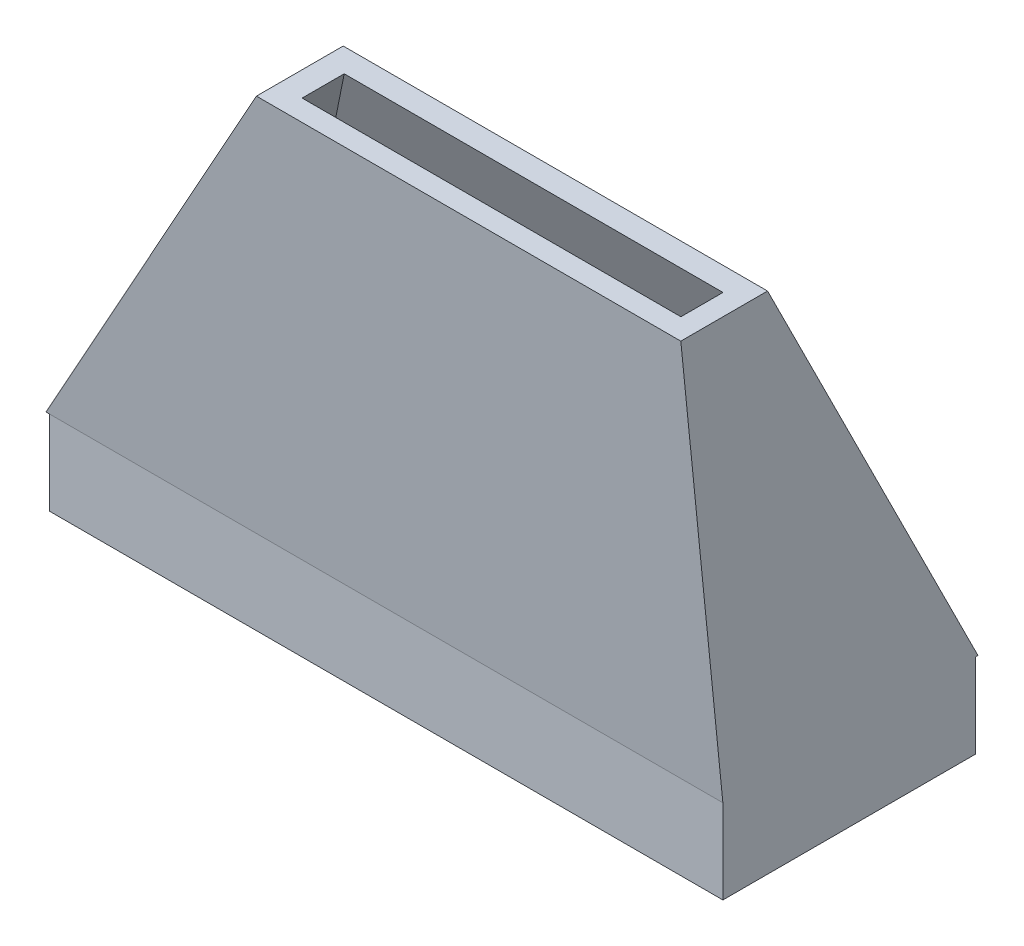
ISO-10303-21;
HEADER;
FILE_DESCRIPTION(('STEP AP214'),'2;1');
FILE_NAME('part.step','',(''),(''),'','','');
FILE_SCHEMA(('AUTOMOTIVE_DESIGN { 1 0 10303 214 1 1 1 1 }'));
ENDSEC;
DATA;
#1=APPLICATION_CONTEXT('core data for automotive mechanical design processes');
#2=APPLICATION_PROTOCOL_DEFINITION('international standard','automotive_design',2000,#1);
#3=PRODUCT_CONTEXT('',#1,'mechanical');
#4=PRODUCT('Part','Part','',(#3));
#5=PRODUCT_RELATED_PRODUCT_CATEGORY('part','',(#4));
#6=PRODUCT_DEFINITION_FORMATION('','',#4);
#7=PRODUCT_DEFINITION_CONTEXT('part definition',#1,'design');
#8=PRODUCT_DEFINITION('design','',#6,#7);
#9=PRODUCT_DEFINITION_SHAPE('','',#8);
#10=(LENGTH_UNIT() NAMED_UNIT(*) SI_UNIT(.MILLI.,.METRE.));
#11=(NAMED_UNIT(*) PLANE_ANGLE_UNIT() SI_UNIT($,.RADIAN.));
#12=(NAMED_UNIT(*) SI_UNIT($,.STERADIAN.) SOLID_ANGLE_UNIT());
#13=UNCERTAINTY_MEASURE_WITH_UNIT(LENGTH_MEASURE(1.E-05),#10,'distance_accuracy_value','');
#14=(GEOMETRIC_REPRESENTATION_CONTEXT(3) GLOBAL_UNCERTAINTY_ASSIGNED_CONTEXT((#13)) GLOBAL_UNIT_ASSIGNED_CONTEXT((#10,
#11,#12)) REPRESENTATION_CONTEXT('',''));
#15=CARTESIAN_POINT('',(0.,0.,0.));
#16=DIRECTION('',(0.,0.,1.));
#17=DIRECTION('',(1.,0.,0.));
#18=AXIS2_PLACEMENT_3D('',#15,#16,#17);
#19=CARTESIAN_POINT('',(0.,19.999999878,0.));
#20=DIRECTION('',(0.,-1.,0.));
#21=DIRECTION('',(0.,0.,-1.));
#22=AXIS2_PLACEMENT_3D('',#19,#20,#21);
#23=PLANE('',#22);
#24=DIRECTION('',(0.,0.,-1.));
#25=VECTOR('',#24,1.);
#26=CARTESIAN_POINT('',(16.,19.999999878,0.));
#27=LINE('',#26,#25);
#28=CARTESIAN_POINT('',(16.,19.999999878,8.00498756217279));
#29=VERTEX_POINT('',#28);
#30=CARTESIAN_POINT('',(16.,19.999999878,3.8819660098861));
#31=VERTEX_POINT('',#30);
#32=EDGE_CURVE('E148',#29,#31,#27,.T.);
#33=ORIENTED_EDGE('',*,*,#32,.T.);
#34=DIRECTION('',(1.,0.,0.));
#35=VECTOR('',#34,1.);
#36=CARTESIAN_POINT('',(0.,19.999999878,3.8819660098861));
#37=LINE('',#36,#35);
#38=CARTESIAN_POINT('',(-4.16619038085212,19.999999878,3.8819660098861));
#39=VERTEX_POINT('',#38);
#40=EDGE_CURVE('E326',#39,#31,#37,.T.);
#41=ORIENTED_EDGE('',*,*,#40,.F.);
#42=DIRECTION('',(0.,0.,-1.));
#43=VECTOR('',#42,1.);
#44=CARTESIAN_POINT('',(-4.16619038085212,19.999999878,0.));
#45=LINE('',#44,#43);
#46=CARTESIAN_POINT('',(-4.16619038085212,19.999999878,8.00498756217279));
#47=VERTEX_POINT('',#46);
#48=EDGE_CURVE('E340',#47,#39,#45,.T.);
#49=ORIENTED_EDGE('',*,*,#48,.F.);
#50=DIRECTION('',(1.,0.,0.));
#51=VECTOR('',#50,1.);
#52=CARTESIAN_POINT('',(0.,19.999999878,8.00498756217279));
#53=LINE('',#52,#51);
#54=EDGE_CURVE('E143',#47,#29,#53,.T.);
#55=ORIENTED_EDGE('',*,*,#54,.T.);
#56=EDGE_LOOP('',(#33,#41,#49,#55));
#57=FACE_BOUND('',#56,.T.);
#58=DIRECTION('',(0.,0.,-1.));
#59=VECTOR('',#58,1.);
#60=CARTESIAN_POINT('',(15.,19.999999878,0.));
#61=LINE('',#60,#59);
#62=CARTESIAN_POINT('',(15.,19.999999878,7.));
#63=VERTEX_POINT('',#62);
#64=CARTESIAN_POINT('',(15.,19.999999878,5.));
#65=VERTEX_POINT('',#64);
#66=EDGE_CURVE('E323',#63,#65,#61,.T.);
#67=ORIENTED_EDGE('',*,*,#66,.F.);
#68=DIRECTION('',(1.,0.,0.));
#69=VECTOR('',#68,1.);
#70=CARTESIAN_POINT('',(0.,19.999999878,7.));
#71=LINE('',#70,#69);
#72=CARTESIAN_POINT('',(-3.,19.999999878,7.));
#73=VERTEX_POINT('',#72);
#74=EDGE_CURVE('E318',#73,#63,#71,.T.);
#75=ORIENTED_EDGE('',*,*,#74,.F.);
#76=DIRECTION('',(0.,0.,-1.));
#77=VECTOR('',#76,1.);
#78=CARTESIAN_POINT('',(-3.,19.999999878,0.));
#79=LINE('',#78,#77);
#80=CARTESIAN_POINT('',(-3.,19.999999878,5.));
#81=VERTEX_POINT('',#80);
#82=EDGE_CURVE('E310',#73,#81,#79,.T.);
#83=ORIENTED_EDGE('',*,*,#82,.T.);
#84=DIRECTION('',(1.,0.,0.));
#85=VECTOR('',#84,1.);
#86=CARTESIAN_POINT('',(0.,19.999999878,5.));
#87=LINE('',#86,#85);
#88=EDGE_CURVE('E299',#81,#65,#87,.T.);
#89=ORIENTED_EDGE('',*,*,#88,.T.);
#90=EDGE_LOOP('',(#67,#75,#83,#89));
#91=FACE_BOUND('',#90,.T.);
#92=ADVANCED_FACE('F139',(#57,#91),#23,.F.);
#93=CARTESIAN_POINT('',(0.,0.,0.));
#94=DIRECTION('',(0.,-1.,0.));
#95=DIRECTION('',(0.,0.,-1.));
#96=AXIS2_PLACEMENT_3D('',#93,#94,#95);
#97=PLANE('',#96);
#98=DIRECTION('',(1.,0.,0.));
#99=VECTOR('',#98,1.);
#100=CARTESIAN_POINT('',(-16.,0.,-6.00498756217278));
#101=LINE('',#100,#99);
#102=CARTESIAN_POINT('',(-16.,0.,-6.00498756217278));
#103=VERTEX_POINT('',#102);
#104=CARTESIAN_POINT('',(16.,0.,-6.00498756217278));
#105=VERTEX_POINT('',#104);
#106=EDGE_CURVE('E277',#103,#105,#101,.T.);
#107=ORIENTED_EDGE('',*,*,#106,.F.);
#108=DIRECTION('',(0.,0.,-1.));
#109=VECTOR('',#108,1.);
#110=CARTESIAN_POINT('',(-16.,0.,-6.00498756217278));
#111=LINE('',#110,#109);
#112=CARTESIAN_POINT('',(-16.,0.,6.00498756217279));
#113=VERTEX_POINT('',#112);
#114=EDGE_CURVE('E156',#113,#103,#111,.T.);
#115=ORIENTED_EDGE('',*,*,#114,.F.);
#116=DIRECTION('',(1.,0.,0.));
#117=VECTOR('',#116,1.);
#118=CARTESIAN_POINT('',(0.,0.,6.00498756217279));
#119=LINE('',#118,#117);
#120=CARTESIAN_POINT('',(-16.1661903808521,0.,6.00498756217278));
#121=VERTEX_POINT('',#120);
#122=EDGE_CURVE('E330',#121,#113,#119,.T.);
#123=ORIENTED_EDGE('',*,*,#122,.F.);
#124=DIRECTION('',(0.,0.,-1.));
#125=VECTOR('',#124,1.);
#126=CARTESIAN_POINT('',(-16.1661903808521,0.,0.));
#127=LINE('',#126,#125);
#128=CARTESIAN_POINT('',(-16.1661903808521,0.,-6.11803399011389));
#129=VERTEX_POINT('',#128);
#130=EDGE_CURVE('E339',#121,#129,#127,.T.);
#131=ORIENTED_EDGE('',*,*,#130,.T.);
#132=DIRECTION('',(1.,0.,0.));
#133=VECTOR('',#132,1.);
#134=CARTESIAN_POINT('',(0.,0.,-6.11803399011389));
#135=LINE('',#134,#133);
#136=CARTESIAN_POINT('',(16.,0.,-6.11803399011389));
#137=VERTEX_POINT('',#136);
#138=EDGE_CURVE('E335',#129,#137,#135,.T.);
#139=ORIENTED_EDGE('',*,*,#138,.T.);
#140=DIRECTION('',(0.,0.,-1.));
#141=VECTOR('',#140,1.);
#142=CARTESIAN_POINT('',(16.,0.,0.));
#143=LINE('',#142,#141);
#144=EDGE_CURVE('E12',#105,#137,#143,.T.);
#145=ORIENTED_EDGE('',*,*,#144,.F.);
#146=EDGE_LOOP('',(#107,#115,#123,#131,#139,#145));
#147=FACE_BOUND('',#146,.T.);
#148=ADVANCED_FACE('F360',(#147),#97,.T.);
#149=CARTESIAN_POINT('',(16.,0.,0.));
#150=DIRECTION('',(-1.,0.,0.));
#151=DIRECTION('',(0.,-1.,0.));
#152=AXIS2_PLACEMENT_3D('',#149,#150,#151);
#153=PLANE('',#152);
#154=DIRECTION('',(0.,0.995037190149893,0.099503719621962));
#155=VECTOR('',#154,1.);
#156=CARTESIAN_POINT('',(16.,-0.594553227532466,5.94553223905686));
#157=LINE('',#156,#155);
#158=CARTESIAN_POINT('',(16.,0.,6.00498756217278));
#159=VERTEX_POINT('',#158);
#160=EDGE_CURVE('E327',#159,#29,#157,.T.);
#161=ORIENTED_EDGE('',*,*,#160,.F.);
#162=DIRECTION('',(0.,1.,0.));
#163=VECTOR('',#162,1.);
#164=CARTESIAN_POINT('',(16.,-4.,6.00498756217278));
#165=LINE('',#164,#163);
#166=CARTESIAN_POINT('',(16.,-4.,6.00498756217278));
#167=VERTEX_POINT('',#166);
#168=EDGE_CURVE('E296',#167,#159,#165,.T.);
#169=ORIENTED_EDGE('',*,*,#168,.F.);
#170=DIRECTION('',(0.,0.,1.));
#171=VECTOR('',#170,1.);
#172=CARTESIAN_POINT('',(16.,-4.,-6.00498756217278));
#173=LINE('',#172,#171);
#174=CARTESIAN_POINT('',(16.,-4.,-6.00498756217278));
#175=VERTEX_POINT('',#174);
#176=EDGE_CURVE('E273',#175,#167,#173,.T.);
#177=ORIENTED_EDGE('',*,*,#176,.F.);
#178=DIRECTION('',(0.,1.,0.));
#179=VECTOR('',#178,1.);
#180=CARTESIAN_POINT('',(16.,-4.,-6.00498756217278));
#181=LINE('',#180,#179);
#182=EDGE_CURVE('E283',#175,#105,#181,.T.);
#183=ORIENTED_EDGE('',*,*,#182,.T.);
#184=ORIENTED_EDGE('',*,*,#144,.T.);
#185=DIRECTION('',(0.,0.894427189908715,0.44721359768236));
#186=VECTOR('',#185,1.);
#187=CARTESIAN_POINT('',(16.,2.44721360500235,-4.89442718014871));
#188=LINE('',#187,#186);
#189=EDGE_CURVE('E331',#137,#31,#188,.T.);
#190=ORIENTED_EDGE('',*,*,#189,.T.);
#191=ORIENTED_EDGE('',*,*,#32,.F.);
#192=EDGE_LOOP('',(#161,#169,#177,#183,#184,#190,#191));
#193=FACE_BOUND('',#192,.T.);
#194=ADVANCED_FACE('F377',(#193),#153,.F.);
#195=CARTESIAN_POINT('',(0.,-0.594553227532461,5.94553223905686));
#196=DIRECTION('',(0.,0.099503719621962,-0.995037190149893));
#197=DIRECTION('',(0.,0.995037190149893,0.099503719621962));
#198=AXIS2_PLACEMENT_3D('',#195,#196,#197);
#199=PLANE('',#198);
#200=DIRECTION('',(0.512614596912502,0.854357656309253,0.0854357661520835));
#201=VECTOR('',#200,1.);
#202=CARTESIAN_POINT('',(-12.1811324742871,6.64176313709365,6.66916387993363));
#203=LINE('',#202,#201);
#204=EDGE_CURVE('E336',#121,#47,#203,.T.);
#205=ORIENTED_EDGE('',*,*,#204,.F.);
#206=ORIENTED_EDGE('',*,*,#122,.T.);
#207=DIRECTION('',(-1.,0.,0.));
#208=VECTOR('',#207,1.);
#209=CARTESIAN_POINT('',(-16.,0.,6.00498756217278));
#210=LINE('',#209,#208);
#211=EDGE_CURVE('E256',#159,#113,#210,.T.);
#212=ORIENTED_EDGE('',*,*,#211,.F.);
#213=ORIENTED_EDGE('',*,*,#160,.T.);
#214=ORIENTED_EDGE('',*,*,#54,.F.);
#215=EDGE_LOOP('',(#205,#206,#212,#213,#214));
#216=FACE_BOUND('',#215,.T.);
#217=ADVANCED_FACE('F362',(#216),#199,.F.);
#218=CARTESIAN_POINT('',(-11.8869046534153,7.13214283555527,0.));
#219=DIRECTION('',(-0.857492924327945,0.514495757735192,0.));
#220=DIRECTION('',(-0.514495757735192,-0.857492924327945,0.));
#221=AXIS2_PLACEMENT_3D('',#218,#219,#220);
#222=PLANE('',#221);
#223=DIRECTION('',(0.472866245535066,0.788110404417635,0.394055204612554));
#224=VECTOR('',#223,1.);
#225=CARTESIAN_POINT('',(-11.4113836776536,7.92467779032363,-2.15569507078181));
#226=LINE('',#225,#224);
#227=EDGE_CURVE('E334',#129,#39,#226,.T.);
#228=ORIENTED_EDGE('',*,*,#227,.F.);
#229=ORIENTED_EDGE('',*,*,#130,.F.);
#230=ORIENTED_EDGE('',*,*,#204,.T.);
#231=ORIENTED_EDGE('',*,*,#48,.T.);
#232=EDGE_LOOP('',(#228,#229,#230,#231));
#233=FACE_BOUND('',#232,.T.);
#234=ADVANCED_FACE('F352',(#233),#222,.T.);
#235=CARTESIAN_POINT('',(0.,2.44721360500236,-4.89442718014871));
#236=DIRECTION('',(0.,0.44721359768236,-0.894427189908715));
#237=DIRECTION('',(0.,0.894427189908715,0.44721359768236));
#238=AXIS2_PLACEMENT_3D('',#235,#236,#237);
#239=PLANE('',#238);
#240=ORIENTED_EDGE('',*,*,#189,.F.);
#241=ORIENTED_EDGE('',*,*,#138,.F.);
#242=ORIENTED_EDGE('',*,*,#227,.T.);
#243=ORIENTED_EDGE('',*,*,#40,.T.);
#244=EDGE_LOOP('',(#240,#241,#242,#243));
#245=FACE_BOUND('',#244,.T.);
#246=ADVANCED_FACE('F141',(#245),#239,.T.);
#247=CARTESIAN_POINT('',(15.,0.,0.));
#248=DIRECTION('',(-1.,0.,0.));
#249=DIRECTION('',(0.,-1.,0.));
#250=AXIS2_PLACEMENT_3D('',#247,#248,#249);
#251=PLANE('',#250);
#252=DIRECTION('',(0.,0.995037190149893,0.099503719621962));
#253=VECTOR('',#252,1.);
#254=CARTESIAN_POINT('',(15.,0.,5.));
#255=LINE('',#254,#253);
#256=CARTESIAN_POINT('',(15.,0.,5.));
#257=VERTEX_POINT('',#256);
#258=EDGE_CURVE('E320',#257,#63,#255,.T.);
#259=ORIENTED_EDGE('',*,*,#258,.T.);
#260=ORIENTED_EDGE('',*,*,#66,.T.);
#261=DIRECTION('',(0.,0.894427189908715,0.44721359768236));
#262=VECTOR('',#261,1.);
#263=CARTESIAN_POINT('',(15.,0.,-4.99999999999999));
#264=LINE('',#263,#262);
#265=CARTESIAN_POINT('',(15.,0.,-5.));
#266=VERTEX_POINT('',#265);
#267=EDGE_CURVE('E305',#266,#65,#264,.T.);
#268=ORIENTED_EDGE('',*,*,#267,.F.);
#269=DIRECTION('',(0.,1.,0.));
#270=VECTOR('',#269,1.);
#271=CARTESIAN_POINT('',(15.,-4.,-5.));
#272=LINE('',#271,#270);
#273=CARTESIAN_POINT('',(15.,-4.,-5.));
#274=VERTEX_POINT('',#273);
#275=EDGE_CURVE('E245',#274,#266,#272,.T.);
#276=ORIENTED_EDGE('',*,*,#275,.F.);
#277=DIRECTION('',(0.,0.,1.));
#278=VECTOR('',#277,1.);
#279=CARTESIAN_POINT('',(15.,-4.,-5.));
#280=LINE('',#279,#278);
#281=CARTESIAN_POINT('',(15.,-4.,5.));
#282=VERTEX_POINT('',#281);
#283=EDGE_CURVE('E238',#274,#282,#280,.T.);
#284=ORIENTED_EDGE('',*,*,#283,.T.);
#285=DIRECTION('',(0.,1.,0.));
#286=VECTOR('',#285,1.);
#287=CARTESIAN_POINT('',(15.,-4.,5.));
#288=LINE('',#287,#286);
#289=EDGE_CURVE('E242',#282,#257,#288,.T.);
#290=ORIENTED_EDGE('',*,*,#289,.T.);
#291=EDGE_LOOP('',(#259,#260,#268,#276,#284,#290));
#292=FACE_BOUND('',#291,.T.);
#293=ADVANCED_FACE('F241',(#292),#251,.T.);
#294=CARTESIAN_POINT('',(0.,-0.495049507910499,4.95049504890697));
#295=DIRECTION('',(0.,0.099503719621962,-0.995037190149893));
#296=DIRECTION('',(0.,0.995037190149893,0.099503719621962));
#297=AXIS2_PLACEMENT_3D('',#294,#295,#296);
#298=PLANE('',#297);
#299=DIRECTION('',(0.512614596912502,0.854357656309253,0.0854357661520835));
#300=VECTOR('',#299,1.);
#301=CARTESIAN_POINT('',(-15.,0.,5.));
#302=LINE('',#301,#300);
#303=CARTESIAN_POINT('',(-15.,0.,5.));
#304=VERTEX_POINT('',#303);
#305=EDGE_CURVE('E313',#304,#73,#302,.T.);
#306=ORIENTED_EDGE('',*,*,#305,.T.);
#307=ORIENTED_EDGE('',*,*,#74,.T.);
#308=ORIENTED_EDGE('',*,*,#258,.F.);
#309=DIRECTION('',(1.,0.,0.));
#310=VECTOR('',#309,1.);
#311=CARTESIAN_POINT('',(0.,0.,5.));
#312=LINE('',#311,#310);
#313=EDGE_CURVE('E255',#304,#257,#312,.T.);
#314=ORIENTED_EDGE('',*,*,#313,.F.);
#315=EDGE_LOOP('',(#306,#307,#308,#314));
#316=FACE_BOUND('',#315,.T.);
#317=ADVANCED_FACE('F409',(#316),#298,.T.);
#318=CARTESIAN_POINT('',(-11.0294117290874,6.61764707782008,0.));
#319=DIRECTION('',(-0.857492924327945,0.514495757735192,0.));
#320=DIRECTION('',(-0.514495757735192,-0.857492924327945,0.));
#321=AXIS2_PLACEMENT_3D('',#318,#319,#320);
#322=PLANE('',#321);
#323=DIRECTION('',(0.472866245535066,0.788110404417635,0.394055204612554));
#324=VECTOR('',#323,1.);
#325=CARTESIAN_POINT('',(-15.,0.,-4.99999999999999));
#326=LINE('',#325,#324);
#327=CARTESIAN_POINT('',(-15.,0.,-4.99999999999999));
#328=VERTEX_POINT('',#327);
#329=EDGE_CURVE('E307',#328,#81,#326,.T.);
#330=ORIENTED_EDGE('',*,*,#329,.T.);
#331=ORIENTED_EDGE('',*,*,#82,.F.);
#332=ORIENTED_EDGE('',*,*,#305,.F.);
#333=DIRECTION('',(0.,0.,-1.));
#334=VECTOR('',#333,1.);
#335=CARTESIAN_POINT('',(-15.,0.,0.));
#336=LINE('',#335,#334);
#337=EDGE_CURVE('E315',#304,#328,#336,.T.);
#338=ORIENTED_EDGE('',*,*,#337,.T.);
#339=EDGE_LOOP('',(#330,#331,#332,#338));
#340=FACE_BOUND('',#339,.T.);
#341=ADVANCED_FACE('F413',(#340),#322,.F.);
#342=CARTESIAN_POINT('',(0.,2.00000000732,-3.99999999024));
#343=DIRECTION('',(0.,0.44721359768236,-0.894427189908715));
#344=DIRECTION('',(0.,0.894427189908715,0.44721359768236));
#345=AXIS2_PLACEMENT_3D('',#342,#343,#344);
#346=PLANE('',#345);
#347=ORIENTED_EDGE('',*,*,#267,.T.);
#348=ORIENTED_EDGE('',*,*,#88,.F.);
#349=ORIENTED_EDGE('',*,*,#329,.F.);
#350=DIRECTION('',(1.,0.,0.));
#351=VECTOR('',#350,1.);
#352=CARTESIAN_POINT('',(0.,0.,-4.99999999999999));
#353=LINE('',#352,#351);
#354=EDGE_CURVE('E302',#328,#266,#353,.T.);
#355=ORIENTED_EDGE('',*,*,#354,.T.);
#356=EDGE_LOOP('',(#347,#348,#349,#355));
#357=FACE_BOUND('',#356,.T.);
#358=ADVANCED_FACE('F418',(#357),#346,.F.);
#359=CARTESIAN_POINT('',(0.,-4.,0.));
#360=DIRECTION('',(0.,1.,0.));
#361=DIRECTION('',(0.,0.,1.));
#362=AXIS2_PLACEMENT_3D('',#359,#360,#361);
#363=PLANE('',#362);
#364=ORIENTED_EDGE('',*,*,#176,.T.);
#365=DIRECTION('',(-1.,0.,0.));
#366=VECTOR('',#365,1.);
#367=CARTESIAN_POINT('',(-16.,-4.,6.00498756217278));
#368=LINE('',#367,#366);
#369=CARTESIAN_POINT('',(-16.,-4.,6.00498756217278));
#370=VERTEX_POINT('',#369);
#371=EDGE_CURVE('E276',#167,#370,#368,.T.);
#372=ORIENTED_EDGE('',*,*,#371,.T.);
#373=DIRECTION('',(0.,0.,-1.));
#374=VECTOR('',#373,1.);
#375=CARTESIAN_POINT('',(-16.,-4.,-6.00498756217278));
#376=LINE('',#375,#374);
#377=CARTESIAN_POINT('',(-16.,-4.,-6.00498756217278));
#378=VERTEX_POINT('',#377);
#379=EDGE_CURVE('E279',#370,#378,#376,.T.);
#380=ORIENTED_EDGE('',*,*,#379,.T.);
#381=DIRECTION('',(1.,0.,0.));
#382=VECTOR('',#381,1.);
#383=CARTESIAN_POINT('',(-16.,-4.,-6.00498756217278));
#384=LINE('',#383,#382);
#385=EDGE_CURVE('E281',#378,#175,#384,.T.);
#386=ORIENTED_EDGE('',*,*,#385,.T.);
#387=EDGE_LOOP('',(#364,#372,#380,#386));
#388=FACE_BOUND('',#387,.T.);
#389=ORIENTED_EDGE('',*,*,#283,.F.);
#390=DIRECTION('',(1.,0.,0.));
#391=VECTOR('',#390,1.);
#392=CARTESIAN_POINT('',(-15.,-4.,-5.));
#393=LINE('',#392,#391);
#394=CARTESIAN_POINT('',(-15.,-4.,-5.));
#395=VERTEX_POINT('',#394);
#396=EDGE_CURVE('E264',#395,#274,#393,.T.);
#397=ORIENTED_EDGE('',*,*,#396,.F.);
#398=DIRECTION('',(0.,0.,-1.));
#399=VECTOR('',#398,1.);
#400=CARTESIAN_POINT('',(-15.,-4.,-5.));
#401=LINE('',#400,#399);
#402=CARTESIAN_POINT('',(-15.,-4.,5.));
#403=VERTEX_POINT('',#402);
#404=EDGE_CURVE('E262',#403,#395,#401,.T.);
#405=ORIENTED_EDGE('',*,*,#404,.F.);
#406=DIRECTION('',(-1.,0.,0.));
#407=VECTOR('',#406,1.);
#408=CARTESIAN_POINT('',(-15.,-4.,5.));
#409=LINE('',#408,#407);
#410=EDGE_CURVE('E249',#282,#403,#409,.T.);
#411=ORIENTED_EDGE('',*,*,#410,.F.);
#412=EDGE_LOOP('',(#389,#397,#405,#411));
#413=FACE_BOUND('',#412,.T.);
#414=ADVANCED_FACE('F260',(#388,#413),#363,.F.);
#415=CARTESIAN_POINT('',(-16.,-4.,6.00498756217278));
#416=DIRECTION('',(0.,0.,-1.));
#417=DIRECTION('',(-1.,0.,0.));
#418=AXIS2_PLACEMENT_3D('',#415,#416,#417);
#419=PLANE('',#418);
#420=ORIENTED_EDGE('',*,*,#211,.T.);
#421=DIRECTION('',(0.,1.,0.));
#422=VECTOR('',#421,1.);
#423=CARTESIAN_POINT('',(-16.,-4.,6.00498756217278));
#424=LINE('',#423,#422);
#425=EDGE_CURVE('E293',#370,#113,#424,.T.);
#426=ORIENTED_EDGE('',*,*,#425,.F.);
#427=ORIENTED_EDGE('',*,*,#371,.F.);
#428=ORIENTED_EDGE('',*,*,#168,.T.);
#429=EDGE_LOOP('',(#420,#426,#427,#428));
#430=FACE_BOUND('',#429,.T.);
#431=ADVANCED_FACE('F366',(#430),#419,.F.);
#432=CARTESIAN_POINT('',(-16.,-4.,-6.00498756217278));
#433=DIRECTION('',(1.,0.,0.));
#434=DIRECTION('',(0.,0.,-1.));
#435=AXIS2_PLACEMENT_3D('',#432,#433,#434);
#436=PLANE('',#435);
#437=ORIENTED_EDGE('',*,*,#114,.T.);
#438=DIRECTION('',(0.,1.,0.));
#439=VECTOR('',#438,1.);
#440=CARTESIAN_POINT('',(-16.,-4.,-6.00498756217278));
#441=LINE('',#440,#439);
#442=EDGE_CURVE('E290',#378,#103,#441,.T.);
#443=ORIENTED_EDGE('',*,*,#442,.F.);
#444=ORIENTED_EDGE('',*,*,#379,.F.);
#445=ORIENTED_EDGE('',*,*,#425,.T.);
#446=EDGE_LOOP('',(#437,#443,#444,#445));
#447=FACE_BOUND('',#446,.T.);
#448=ADVANCED_FACE('F370',(#447),#436,.F.);
#449=CARTESIAN_POINT('',(-16.,-4.,-6.00498756217278));
#450=DIRECTION('',(0.,0.,1.));
#451=DIRECTION('',(1.,0.,0.));
#452=AXIS2_PLACEMENT_3D('',#449,#450,#451);
#453=PLANE('',#452);
#454=ORIENTED_EDGE('',*,*,#106,.T.);
#455=ORIENTED_EDGE('',*,*,#182,.F.);
#456=ORIENTED_EDGE('',*,*,#385,.F.);
#457=ORIENTED_EDGE('',*,*,#442,.T.);
#458=EDGE_LOOP('',(#454,#455,#456,#457));
#459=FACE_BOUND('',#458,.T.);
#460=ADVANCED_FACE('F379',(#459),#453,.F.);
#461=CARTESIAN_POINT('',(-15.,-4.,5.));
#462=DIRECTION('',(0.,0.,-1.));
#463=DIRECTION('',(-1.,0.,0.));
#464=AXIS2_PLACEMENT_3D('',#461,#462,#463);
#465=PLANE('',#464);
#466=ORIENTED_EDGE('',*,*,#313,.T.);
#467=ORIENTED_EDGE('',*,*,#289,.F.);
#468=ORIENTED_EDGE('',*,*,#410,.T.);
#469=DIRECTION('',(0.,1.,0.));
#470=VECTOR('',#469,1.);
#471=CARTESIAN_POINT('',(-15.,-4.,5.));
#472=LINE('',#471,#470);
#473=EDGE_CURVE('E257',#403,#304,#472,.T.);
#474=ORIENTED_EDGE('',*,*,#473,.T.);
#475=EDGE_LOOP('',(#466,#467,#468,#474));
#476=FACE_BOUND('',#475,.T.);
#477=ADVANCED_FACE('F252',(#476),#465,.T.);
#478=CARTESIAN_POINT('',(-15.,-4.,-5.));
#479=DIRECTION('',(1.,0.,0.));
#480=DIRECTION('',(0.,0.,-1.));
#481=AXIS2_PLACEMENT_3D('',#478,#479,#480);
#482=PLANE('',#481);
#483=ORIENTED_EDGE('',*,*,#337,.F.);
#484=ORIENTED_EDGE('',*,*,#473,.F.);
#485=ORIENTED_EDGE('',*,*,#404,.T.);
#486=DIRECTION('',(0.,1.,0.));
#487=VECTOR('',#486,1.);
#488=CARTESIAN_POINT('',(-15.,-4.,-5.));
#489=LINE('',#488,#487);
#490=EDGE_CURVE('E269',#395,#328,#489,.T.);
#491=ORIENTED_EDGE('',*,*,#490,.T.);
#492=EDGE_LOOP('',(#483,#484,#485,#491));
#493=FACE_BOUND('',#492,.T.);
#494=ADVANCED_FACE('F386',(#493),#482,.T.);
#495=CARTESIAN_POINT('',(-15.,-4.,-5.));
#496=DIRECTION('',(0.,0.,1.));
#497=DIRECTION('',(1.,0.,0.));
#498=AXIS2_PLACEMENT_3D('',#495,#496,#497);
#499=PLANE('',#498);
#500=ORIENTED_EDGE('',*,*,#354,.F.);
#501=ORIENTED_EDGE('',*,*,#490,.F.);
#502=ORIENTED_EDGE('',*,*,#396,.T.);
#503=ORIENTED_EDGE('',*,*,#275,.T.);
#504=EDGE_LOOP('',(#500,#501,#502,#503));
#505=FACE_BOUND('',#504,.T.);
#506=ADVANCED_FACE('F434',(#505),#499,.T.);
#507=CLOSED_SHELL('',(#92,#148,#194,#217,#234,#246,#293,#317,#341,#358,#414,#431,#448,#460,#477,
#494,#506));
#508=MANIFOLD_SOLID_BREP('B2',#507);
#509=ADVANCED_BREP_SHAPE_REPRESENTATION('',(#18,#508),#14);
#510=SHAPE_DEFINITION_REPRESENTATION(#9,#509);
ENDSEC;
END-ISO-10303-21;
